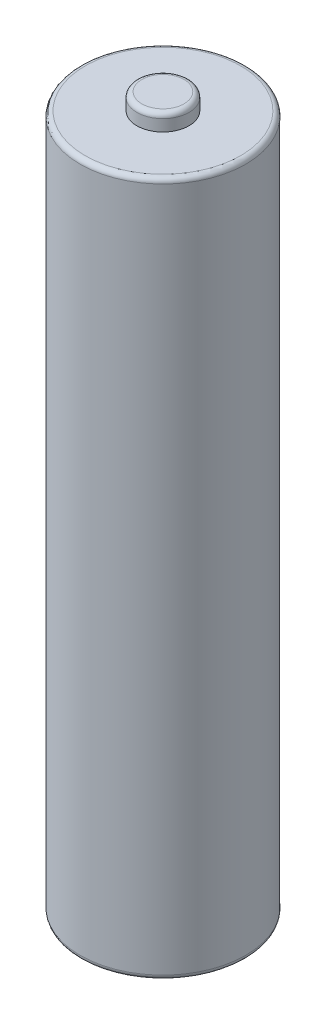
ISO-10303-21;
HEADER;
FILE_DESCRIPTION(('STEP AP214'),'2;1');
FILE_NAME('part.step','',(''),(''),'','','');
FILE_SCHEMA(('AUTOMOTIVE_DESIGN { 1 0 10303 214 1 1 1 1 }'));
ENDSEC;
DATA;
#1=APPLICATION_CONTEXT('core data for automotive mechanical design processes');
#2=APPLICATION_PROTOCOL_DEFINITION('international standard','automotive_design',2000,#1);
#3=PRODUCT_CONTEXT('',#1,'mechanical');
#4=PRODUCT('Part','Part','',(#3));
#5=PRODUCT_RELATED_PRODUCT_CATEGORY('part','',(#4));
#6=PRODUCT_DEFINITION_FORMATION('','',#4);
#7=PRODUCT_DEFINITION_CONTEXT('part definition',#1,'design');
#8=PRODUCT_DEFINITION('design','',#6,#7);
#9=PRODUCT_DEFINITION_SHAPE('','',#8);
#10=(LENGTH_UNIT() NAMED_UNIT(*) SI_UNIT(.MILLI.,.METRE.));
#11=(NAMED_UNIT(*) PLANE_ANGLE_UNIT() SI_UNIT($,.RADIAN.));
#12=(NAMED_UNIT(*) SI_UNIT($,.STERADIAN.) SOLID_ANGLE_UNIT());
#13=UNCERTAINTY_MEASURE_WITH_UNIT(LENGTH_MEASURE(1.E-05),#10,'distance_accuracy_value','');
#14=(GEOMETRIC_REPRESENTATION_CONTEXT(3) GLOBAL_UNCERTAINTY_ASSIGNED_CONTEXT((#13)) GLOBAL_UNIT_ASSIGNED_CONTEXT((#10,
#11,#12)) REPRESENTATION_CONTEXT('',''));
#15=CARTESIAN_POINT('',(0.,0.,0.));
#16=DIRECTION('',(0.,0.,1.));
#17=DIRECTION('',(1.,0.,0.));
#18=AXIS2_PLACEMENT_3D('',#15,#16,#17);
#19=CARTESIAN_POINT('',(0.,42.,0.));
#20=DIRECTION('',(0.,-1.,0.));
#21=DIRECTION('',(0.,0.,-1.));
#22=AXIS2_PLACEMENT_3D('',#19,#20,#21);
#23=CYLINDRICAL_SURFACE('',#22,5.);
#24=CARTESIAN_POINT('',(0.,0.300000000000002,0.));
#25=DIRECTION('',(0.,1.,0.));
#26=DIRECTION('',(0.,0.,1.));
#27=AXIS2_PLACEMENT_3D('',#24,#25,#26);
#28=CIRCLE('',#27,5.);
#29=CARTESIAN_POINT('',(0.,0.300000000000002,5.));
#30=VERTEX_POINT('',#29);
#31=EDGE_CURVE('E53',#30,#30,#28,.T.);
#32=ORIENTED_EDGE('',*,*,#31,.T.);
#33=EDGE_LOOP('',(#32));
#34=FACE_BOUND('',#33,.T.);
#35=CARTESIAN_POINT('',(0.,41.7,0.));
#36=DIRECTION('',(0.,1.,0.));
#37=DIRECTION('',(0.,0.,1.));
#38=AXIS2_PLACEMENT_3D('',#35,#36,#37);
#39=CIRCLE('',#38,5.);
#40=CARTESIAN_POINT('',(0.,41.7,5.));
#41=VERTEX_POINT('',#40);
#42=EDGE_CURVE('E56',#41,#41,#39,.F.);
#43=ORIENTED_EDGE('',*,*,#42,.T.);
#44=EDGE_LOOP('',(#43));
#45=FACE_BOUND('',#44,.T.);
#46=ADVANCED_FACE('F33',(#34,#45),#23,.T.);
#47=CARTESIAN_POINT('',(0.,42.,0.));
#48=DIRECTION('',(0.,1.,0.));
#49=DIRECTION('',(0.,0.,1.));
#50=AXIS2_PLACEMENT_3D('',#47,#48,#49);
#51=PLANE('',#50);
#52=CARTESIAN_POINT('',(0.,42.,0.));
#53=DIRECTION('',(0.,1.,0.));
#54=DIRECTION('',(0.,0.,1.));
#55=AXIS2_PLACEMENT_3D('',#52,#53,#54);
#56=CIRCLE('',#55,4.7);
#57=CARTESIAN_POINT('',(0.,42.,4.7));
#58=VERTEX_POINT('',#57);
#59=EDGE_CURVE('E44',#58,#58,#56,.T.);
#60=ORIENTED_EDGE('',*,*,#59,.T.);
#61=EDGE_LOOP('',(#60));
#62=FACE_BOUND('',#61,.T.);
#63=CARTESIAN_POINT('',(0.,42.,0.));
#64=DIRECTION('',(0.,1.,0.));
#65=DIRECTION('',(0.,0.,1.));
#66=AXIS2_PLACEMENT_3D('',#63,#64,#65);
#67=CIRCLE('',#66,1.575);
#68=CARTESIAN_POINT('',(0.,42.,1.575));
#69=VERTEX_POINT('',#68);
#70=EDGE_CURVE('E59',#69,#69,#67,.T.);
#71=ORIENTED_EDGE('',*,*,#70,.F.);
#72=EDGE_LOOP('',(#71));
#73=FACE_BOUND('',#72,.T.);
#74=ADVANCED_FACE('F65',(#62,#73),#51,.T.);
#75=CARTESIAN_POINT('',(0.,0.,0.));
#76=DIRECTION('',(0.,1.,0.));
#77=DIRECTION('',(0.,0.,1.));
#78=AXIS2_PLACEMENT_3D('',#75,#76,#77);
#79=PLANE('',#78);
#80=CARTESIAN_POINT('',(0.,0.,0.));
#81=DIRECTION('',(0.,1.,0.));
#82=DIRECTION('',(0.,0.,1.));
#83=AXIS2_PLACEMENT_3D('',#80,#81,#82);
#84=CIRCLE('',#83,4.7);
#85=CARTESIAN_POINT('',(0.,0.,4.7));
#86=VERTEX_POINT('',#85);
#87=EDGE_CURVE('E48',#86,#86,#84,.F.);
#88=ORIENTED_EDGE('',*,*,#87,.T.);
#89=EDGE_LOOP('',(#88));
#90=FACE_BOUND('',#89,.T.);
#91=ADVANCED_FACE('F67',(#90),#79,.F.);
#92=CARTESIAN_POINT('',(0.,43.,0.));
#93=DIRECTION('',(0.,-1.,0.));
#94=DIRECTION('',(0.,0.,-1.));
#95=AXIS2_PLACEMENT_3D('',#92,#93,#94);
#96=CYLINDRICAL_SURFACE('',#95,1.575);
#97=CARTESIAN_POINT('',(0.,42.7,0.));
#98=DIRECTION('',(0.,1.,0.));
#99=DIRECTION('',(0.,0.,1.));
#100=AXIS2_PLACEMENT_3D('',#97,#98,#99);
#101=CIRCLE('',#100,1.575);
#102=CARTESIAN_POINT('',(0.,42.7,1.575));
#103=VERTEX_POINT('',#102);
#104=EDGE_CURVE('E10',#103,#103,#101,.F.);
#105=ORIENTED_EDGE('',*,*,#104,.T.);
#106=EDGE_LOOP('',(#105));
#107=FACE_BOUND('',#106,.T.);
#108=ORIENTED_EDGE('',*,*,#70,.T.);
#109=EDGE_LOOP('',(#108));
#110=FACE_BOUND('',#109,.T.);
#111=ADVANCED_FACE('F63',(#107,#110),#96,.T.);
#112=CARTESIAN_POINT('',(0.,43.,0.));
#113=DIRECTION('',(0.,1.,0.));
#114=DIRECTION('',(0.,0.,1.));
#115=AXIS2_PLACEMENT_3D('',#112,#113,#114);
#116=PLANE('',#115);
#117=CARTESIAN_POINT('',(0.,43.,0.));
#118=DIRECTION('',(0.,1.,0.));
#119=DIRECTION('',(0.,0.,1.));
#120=AXIS2_PLACEMENT_3D('',#117,#118,#119);
#121=CIRCLE('',#120,1.275);
#122=CARTESIAN_POINT('',(0.,43.,1.275));
#123=VERTEX_POINT('',#122);
#124=EDGE_CURVE('E40',#123,#123,#121,.T.);
#125=ORIENTED_EDGE('',*,*,#124,.T.);
#126=EDGE_LOOP('',(#125));
#127=FACE_BOUND('',#126,.T.);
#128=ADVANCED_FACE('F84',(#127),#116,.T.);
#129=CARTESIAN_POINT('',(0.,0.300000000000002,0.));
#130=DIRECTION('',(0.,1.,0.));
#131=DIRECTION('',(0.,0.,1.));
#132=AXIS2_PLACEMENT_3D('',#129,#130,#131);
#133=TOROIDAL_SURFACE('',#132,4.7,0.3);
#134=ORIENTED_EDGE('',*,*,#87,.F.);
#135=EDGE_LOOP('',(#134));
#136=FACE_BOUND('',#135,.T.);
#137=ORIENTED_EDGE('',*,*,#31,.F.);
#138=EDGE_LOOP('',(#137));
#139=FACE_BOUND('',#138,.T.);
#140=ADVANCED_FACE('F81',(#136,#139),#133,.T.);
#141=CARTESIAN_POINT('',(0.,41.7,0.));
#142=DIRECTION('',(0.,1.,0.));
#143=DIRECTION('',(0.,0.,1.));
#144=AXIS2_PLACEMENT_3D('',#141,#142,#143);
#145=TOROIDAL_SURFACE('',#144,4.7,0.3);
#146=ORIENTED_EDGE('',*,*,#42,.F.);
#147=EDGE_LOOP('',(#146));
#148=FACE_BOUND('',#147,.T.);
#149=ORIENTED_EDGE('',*,*,#59,.F.);
#150=EDGE_LOOP('',(#149));
#151=FACE_BOUND('',#150,.T.);
#152=ADVANCED_FACE('F83',(#148,#151),#145,.T.);
#153=CARTESIAN_POINT('',(0.,42.7,0.));
#154=DIRECTION('',(0.,1.,0.));
#155=DIRECTION('',(0.,0.,1.));
#156=AXIS2_PLACEMENT_3D('',#153,#154,#155);
#157=TOROIDAL_SURFACE('',#156,1.275,0.3);
#158=ORIENTED_EDGE('',*,*,#104,.F.);
#159=EDGE_LOOP('',(#158));
#160=FACE_BOUND('',#159,.T.);
#161=ORIENTED_EDGE('',*,*,#124,.F.);
#162=EDGE_LOOP('',(#161));
#163=FACE_BOUND('',#162,.T.);
#164=ADVANCED_FACE('F35',(#160,#163),#157,.T.);
#165=CLOSED_SHELL('',(#46,#74,#91,#111,#128,#140,#152,#164));
#166=MANIFOLD_SOLID_BREP('B2',#165);
#167=ADVANCED_BREP_SHAPE_REPRESENTATION('',(#18,#166),#14);
#168=SHAPE_DEFINITION_REPRESENTATION(#9,#167);
ENDSEC;
END-ISO-10303-21;
